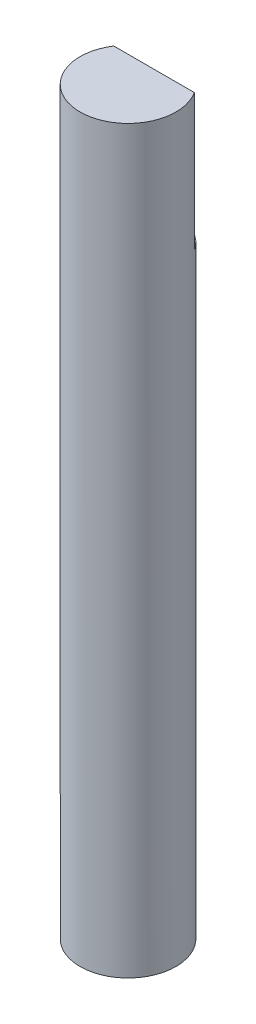
ISO-10303-21;
HEADER;
FILE_DESCRIPTION(('STEP AP214'),'2;1');
FILE_NAME('part.step','',(''),(''),'','','');
FILE_SCHEMA(('AUTOMOTIVE_DESIGN { 1 0 10303 214 1 1 1 1 }'));
ENDSEC;
DATA;
#1=APPLICATION_CONTEXT('core data for automotive mechanical design processes');
#2=APPLICATION_PROTOCOL_DEFINITION('international standard','automotive_design',2000,#1);
#3=PRODUCT_CONTEXT('',#1,'mechanical');
#4=PRODUCT('Part','Part','',(#3));
#5=PRODUCT_RELATED_PRODUCT_CATEGORY('part','',(#4));
#6=PRODUCT_DEFINITION_FORMATION('','',#4);
#7=PRODUCT_DEFINITION_CONTEXT('part definition',#1,'design');
#8=PRODUCT_DEFINITION('design','',#6,#7);
#9=PRODUCT_DEFINITION_SHAPE('','',#8);
#10=(LENGTH_UNIT() NAMED_UNIT(*) SI_UNIT(.MILLI.,.METRE.));
#11=(NAMED_UNIT(*) PLANE_ANGLE_UNIT() SI_UNIT($,.RADIAN.));
#12=(NAMED_UNIT(*) SI_UNIT($,.STERADIAN.) SOLID_ANGLE_UNIT());
#13=UNCERTAINTY_MEASURE_WITH_UNIT(LENGTH_MEASURE(1.E-05),#10,'distance_accuracy_value','');
#14=(GEOMETRIC_REPRESENTATION_CONTEXT(3) GLOBAL_UNCERTAINTY_ASSIGNED_CONTEXT((#13)) GLOBAL_UNIT_ASSIGNED_CONTEXT((#10,
#11,#12)) REPRESENTATION_CONTEXT('',''));
#15=CARTESIAN_POINT('',(0.,0.,0.));
#16=DIRECTION('',(0.,0.,1.));
#17=DIRECTION('',(1.,0.,0.));
#18=AXIS2_PLACEMENT_3D('',#15,#16,#17);
#19=CARTESIAN_POINT('',(0.,54.,0.));
#20=DIRECTION('',(0.,-1.,0.));
#21=DIRECTION('',(0.,0.,-1.));
#22=AXIS2_PLACEMENT_3D('',#19,#20,#21);
#23=CYLINDRICAL_SURFACE('',#22,3.5);
#24=CARTESIAN_POINT('',(0.,54.,0.));
#25=DIRECTION('',(0.,1.,0.));
#26=DIRECTION('',(0.,0.,1.));
#27=AXIS2_PLACEMENT_3D('',#24,#25,#26);
#28=CIRCLE('',#27,3.5);
#29=CARTESIAN_POINT('',(-2.93938769133981,54.,-1.9));
#30=VERTEX_POINT('',#29);
#31=CARTESIAN_POINT('',(2.93938769133981,54.,-1.9));
#32=VERTEX_POINT('',#31);
#33=EDGE_CURVE('E62',#30,#32,#28,.T.);
#34=ORIENTED_EDGE('',*,*,#33,.F.);
#35=DIRECTION('',(0.,-1.,0.));
#36=VECTOR('',#35,1.);
#37=CARTESIAN_POINT('',(-2.93938769133981,54.,-1.9));
#38=LINE('',#37,#36);
#39=CARTESIAN_POINT('',(-2.93938769133981,44.,-1.9));
#40=VERTEX_POINT('',#39);
#41=EDGE_CURVE('E48',#30,#40,#38,.T.);
#42=ORIENTED_EDGE('',*,*,#41,.T.);
#43=CARTESIAN_POINT('',(0.,44.,0.));
#44=DIRECTION('',(0.,1.,0.));
#45=DIRECTION('',(0.,0.,1.));
#46=AXIS2_PLACEMENT_3D('',#43,#44,#45);
#47=CIRCLE('',#46,3.5);
#48=CARTESIAN_POINT('',(2.93938769133981,44.,-1.9));
#49=VERTEX_POINT('',#48);
#50=EDGE_CURVE('E11',#49,#40,#47,.T.);
#51=ORIENTED_EDGE('',*,*,#50,.F.);
#52=DIRECTION('',(0.,-1.,0.));
#53=VECTOR('',#52,1.);
#54=CARTESIAN_POINT('',(2.93938769133981,54.,-1.9));
#55=LINE('',#54,#53);
#56=EDGE_CURVE('E53',#49,#32,#55,.F.);
#57=ORIENTED_EDGE('',*,*,#56,.T.);
#58=EDGE_LOOP('',(#34,#42,#51,#57));
#59=FACE_BOUND('',#58,.T.);
#60=CARTESIAN_POINT('',(0.,0.,0.));
#61=DIRECTION('',(0.,1.,0.));
#62=DIRECTION('',(0.,0.,1.));
#63=AXIS2_PLACEMENT_3D('',#60,#61,#62);
#64=CIRCLE('',#63,3.5);
#65=CARTESIAN_POINT('',(0.,0.,3.5));
#66=VERTEX_POINT('',#65);
#67=EDGE_CURVE('E69',#66,#66,#64,.T.);
#68=ORIENTED_EDGE('',*,*,#67,.T.);
#69=EDGE_LOOP('',(#68));
#70=FACE_BOUND('',#69,.T.);
#71=ADVANCED_FACE('F34',(#59,#70),#23,.T.);
#72=CARTESIAN_POINT('',(0.,54.,0.));
#73=DIRECTION('',(0.,1.,0.));
#74=DIRECTION('',(0.,0.,1.));
#75=AXIS2_PLACEMENT_3D('',#72,#73,#74);
#76=PLANE('',#75);
#77=DIRECTION('',(1.,0.,0.));
#78=VECTOR('',#77,1.);
#79=CARTESIAN_POINT('',(0.,54.,-1.9));
#80=LINE('',#79,#78);
#81=EDGE_CURVE('E41',#30,#32,#80,.T.);
#82=ORIENTED_EDGE('',*,*,#81,.F.);
#83=ORIENTED_EDGE('',*,*,#33,.T.);
#84=EDGE_LOOP('',(#82,#83));
#85=FACE_BOUND('',#84,.T.);
#86=ADVANCED_FACE('F68',(#85),#76,.T.);
#87=CARTESIAN_POINT('',(0.,0.,0.));
#88=DIRECTION('',(0.,1.,0.));
#89=DIRECTION('',(0.,0.,1.));
#90=AXIS2_PLACEMENT_3D('',#87,#88,#89);
#91=PLANE('',#90);
#92=ORIENTED_EDGE('',*,*,#67,.F.);
#93=EDGE_LOOP('',(#92));
#94=FACE_BOUND('',#93,.T.);
#95=ADVANCED_FACE('F78',(#94),#91,.F.);
#96=CARTESIAN_POINT('',(0.,44.,0.));
#97=DIRECTION('',(0.,1.,0.));
#98=DIRECTION('',(0.,0.,1.));
#99=AXIS2_PLACEMENT_3D('',#96,#97,#98);
#100=PLANE('',#99);
#101=ORIENTED_EDGE('',*,*,#50,.T.);
#102=DIRECTION('',(1.,0.,0.));
#103=VECTOR('',#102,1.);
#104=CARTESIAN_POINT('',(-4.39476173747374,44.,-1.9));
#105=LINE('',#104,#103);
#106=EDGE_CURVE('E66',#40,#49,#105,.T.);
#107=ORIENTED_EDGE('',*,*,#106,.T.);
#108=EDGE_LOOP('',(#101,#107));
#109=FACE_BOUND('',#108,.T.);
#110=ADVANCED_FACE('F76',(#109),#100,.T.);
#111=CARTESIAN_POINT('',(-4.39476173747374,44.,-1.9));
#112=DIRECTION('',(0.,0.,1.));
#113=DIRECTION('',(1.,0.,0.));
#114=AXIS2_PLACEMENT_3D('',#111,#112,#113);
#115=PLANE('',#114);
#116=ORIENTED_EDGE('',*,*,#81,.T.);
#117=ORIENTED_EDGE('',*,*,#56,.F.);
#118=ORIENTED_EDGE('',*,*,#106,.F.);
#119=ORIENTED_EDGE('',*,*,#41,.F.);
#120=EDGE_LOOP('',(#116,#117,#118,#119));
#121=FACE_BOUND('',#120,.T.);
#122=ADVANCED_FACE('F58',(#121),#115,.F.);
#123=CLOSED_SHELL('',(#71,#86,#95,#110,#122));
#124=MANIFOLD_SOLID_BREP('B2',#123);
#125=ADVANCED_BREP_SHAPE_REPRESENTATION('',(#18,#124),#14);
#126=SHAPE_DEFINITION_REPRESENTATION(#9,#125);
ENDSEC;
END-ISO-10303-21;
